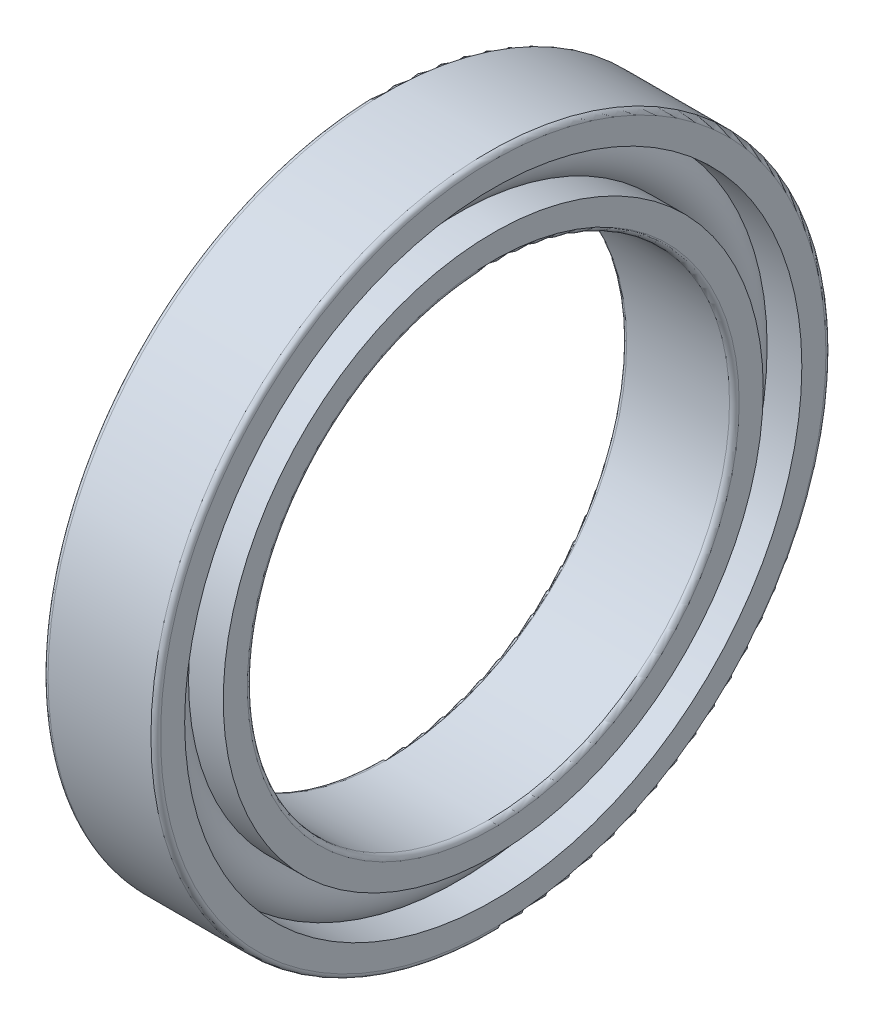
ISO-10303-21;
HEADER;
FILE_DESCRIPTION(('STEP AP214'),'2;1');
FILE_NAME('part.step','',(''),(''),'','','');
FILE_SCHEMA(('AUTOMOTIVE_DESIGN { 1 0 10303 214 1 1 1 1 }'));
ENDSEC;
DATA;
#1=APPLICATION_CONTEXT('core data for automotive mechanical design processes');
#2=APPLICATION_PROTOCOL_DEFINITION('international standard','automotive_design',2000,#1);
#3=PRODUCT_CONTEXT('',#1,'mechanical');
#4=PRODUCT('Part','Part','',(#3));
#5=PRODUCT_RELATED_PRODUCT_CATEGORY('part','',(#4));
#6=PRODUCT_DEFINITION_FORMATION('','',#4);
#7=PRODUCT_DEFINITION_CONTEXT('part definition',#1,'design');
#8=PRODUCT_DEFINITION('design','',#6,#7);
#9=PRODUCT_DEFINITION_SHAPE('','',#8);
#10=(LENGTH_UNIT() NAMED_UNIT(*) SI_UNIT(.MILLI.,.METRE.));
#11=(NAMED_UNIT(*) PLANE_ANGLE_UNIT() SI_UNIT($,.RADIAN.));
#12=(NAMED_UNIT(*) SI_UNIT($,.STERADIAN.) SOLID_ANGLE_UNIT());
#13=UNCERTAINTY_MEASURE_WITH_UNIT(LENGTH_MEASURE(1.E-05),#10,'distance_accuracy_value','');
#14=(GEOMETRIC_REPRESENTATION_CONTEXT(3) GLOBAL_UNCERTAINTY_ASSIGNED_CONTEXT((#13)) GLOBAL_UNIT_ASSIGNED_CONTEXT((#10,
#11,#12)) REPRESENTATION_CONTEXT('',''));
#15=CARTESIAN_POINT('',(0.,0.,0.));
#16=DIRECTION('',(0.,0.,1.));
#17=DIRECTION('',(1.,0.,0.));
#18=AXIS2_PLACEMENT_3D('',#15,#16,#17);
#19=CARTESIAN_POINT('',(0.,0.,0.));
#20=DIRECTION('',(-1.,0.,0.));
#21=DIRECTION('',(0.,0.,1.));
#22=AXIS2_PLACEMENT_3D('',#19,#20,#21);
#23=TOROIDAL_SURFACE('',#22,18.,1.8);
#24=CARTESIAN_POINT('',(1.34164078649987,0.,0.));
#25=DIRECTION('',(-1.,0.,0.));
#26=DIRECTION('',(0.,0.,1.));
#27=AXIS2_PLACEMENT_3D('',#24,#25,#26);
#28=CIRCLE('',#27,19.2);
#29=CARTESIAN_POINT('',(1.34164078649987,0.,19.2));
#30=VERTEX_POINT('',#29);
#31=EDGE_CURVE('E36',#30,#30,#28,.F.);
#32=ORIENTED_EDGE('',*,*,#31,.T.);
#33=EDGE_LOOP('',(#32));
#34=FACE_BOUND('',#33,.T.);
#35=CARTESIAN_POINT('',(1.34164078649988,0.,0.));
#36=DIRECTION('',(-1.,0.,0.));
#37=DIRECTION('',(0.,0.,1.));
#38=AXIS2_PLACEMENT_3D('',#35,#36,#37);
#39=CIRCLE('',#38,16.8);
#40=CARTESIAN_POINT('',(1.34164078649988,0.,16.8));
#41=VERTEX_POINT('',#40);
#42=EDGE_CURVE('E10',#41,#41,#39,.T.);
#43=ORIENTED_EDGE('',*,*,#42,.T.);
#44=EDGE_LOOP('',(#43));
#45=FACE_BOUND('',#44,.T.);
#46=ADVANCED_FACE('F32',(#34,#45),#23,.T.);
#47=CARTESIAN_POINT('',(-20.6375,0.,0.));
#48=DIRECTION('',(1.,0.,0.));
#49=DIRECTION('',(0.,0.,-1.));
#50=AXIS2_PLACEMENT_3D('',#47,#48,#49);
#51=CYLINDRICAL_SURFACE('',#50,16.8);
#52=CARTESIAN_POINT('',(3.5,0.,0.));
#53=DIRECTION('',(1.,0.,0.));
#54=DIRECTION('',(0.,0.,-1.));
#55=AXIS2_PLACEMENT_3D('',#52,#53,#54);
#56=CIRCLE('',#55,16.8);
#57=CARTESIAN_POINT('',(3.5,0.,-16.8));
#58=VERTEX_POINT('',#57);
#59=EDGE_CURVE('E45',#58,#58,#56,.T.);
#60=ORIENTED_EDGE('',*,*,#59,.F.);
#61=EDGE_LOOP('',(#60));
#62=FACE_BOUND('',#61,.T.);
#63=ORIENTED_EDGE('',*,*,#42,.F.);
#64=EDGE_LOOP('',(#63));
#65=FACE_BOUND('',#64,.T.);
#66=ADVANCED_FACE('F84',(#62,#65),#51,.T.);
#67=CARTESIAN_POINT('',(-20.6375,0.,0.));
#68=DIRECTION('',(1.,0.,0.));
#69=DIRECTION('',(0.,0.,-1.));
#70=AXIS2_PLACEMENT_3D('',#67,#68,#69);
#71=CYLINDRICAL_SURFACE('',#70,16.8);
#72=CARTESIAN_POINT('',(-3.5,0.,0.));
#73=DIRECTION('',(1.,0.,0.));
#74=DIRECTION('',(0.,0.,-1.));
#75=AXIS2_PLACEMENT_3D('',#72,#73,#74);
#76=CIRCLE('',#75,16.8);
#77=CARTESIAN_POINT('',(-3.5,0.,-16.8));
#78=VERTEX_POINT('',#77);
#79=EDGE_CURVE('E54',#78,#78,#76,.T.);
#80=ORIENTED_EDGE('',*,*,#79,.T.);
#81=EDGE_LOOP('',(#80));
#82=FACE_BOUND('',#81,.T.);
#83=CARTESIAN_POINT('',(-1.34164078649988,0.,0.));
#84=DIRECTION('',(1.,0.,0.));
#85=DIRECTION('',(0.,0.,-1.));
#86=AXIS2_PLACEMENT_3D('',#83,#84,#85);
#87=CIRCLE('',#86,16.8);
#88=CARTESIAN_POINT('',(-1.34164078649988,0.,-16.8));
#89=VERTEX_POINT('',#88);
#90=EDGE_CURVE('E40',#89,#89,#87,.T.);
#91=ORIENTED_EDGE('',*,*,#90,.F.);
#92=EDGE_LOOP('',(#91));
#93=FACE_BOUND('',#92,.T.);
#94=ADVANCED_FACE('F87',(#82,#93),#71,.T.);
#95=CARTESIAN_POINT('',(3.5,15.3,0.));
#96=DIRECTION('',(1.,0.,0.));
#97=DIRECTION('',(0.,0.,-1.));
#98=AXIS2_PLACEMENT_3D('',#95,#96,#97);
#99=PLANE('',#98);
#100=ORIENTED_EDGE('',*,*,#59,.T.);
#101=EDGE_LOOP('',(#100));
#102=FACE_BOUND('',#101,.T.);
#103=CARTESIAN_POINT('',(3.5,0.,0.));
#104=DIRECTION('',(1.,0.,0.));
#105=DIRECTION('',(0.,0.,-1.));
#106=AXIS2_PLACEMENT_3D('',#103,#104,#105);
#107=CIRCLE('',#106,15.3);
#108=CARTESIAN_POINT('',(3.5,0.,-15.3));
#109=VERTEX_POINT('',#108);
#110=EDGE_CURVE('E76',#109,#109,#107,.T.);
#111=ORIENTED_EDGE('',*,*,#110,.F.);
#112=EDGE_LOOP('',(#111));
#113=FACE_BOUND('',#112,.T.);
#114=ADVANCED_FACE('F81',(#102,#113),#99,.T.);
#115=CARTESIAN_POINT('',(3.2,0.,0.));
#116=DIRECTION('',(1.,0.,0.));
#117=DIRECTION('',(0.,0.,-1.));
#118=AXIS2_PLACEMENT_3D('',#115,#116,#117);
#119=TOROIDAL_SURFACE('',#118,15.3,0.3);
#120=ORIENTED_EDGE('',*,*,#110,.T.);
#121=EDGE_LOOP('',(#120));
#122=FACE_BOUND('',#121,.T.);
#123=CARTESIAN_POINT('',(3.2,0.,0.));
#124=DIRECTION('',(1.,0.,0.));
#125=DIRECTION('',(0.,0.,-1.));
#126=AXIS2_PLACEMENT_3D('',#123,#124,#125);
#127=CIRCLE('',#126,15.);
#128=CARTESIAN_POINT('',(3.2,0.,-15.));
#129=VERTEX_POINT('',#128);
#130=EDGE_CURVE('E73',#129,#129,#127,.T.);
#131=ORIENTED_EDGE('',*,*,#130,.F.);
#132=EDGE_LOOP('',(#131));
#133=FACE_BOUND('',#132,.T.);
#134=ADVANCED_FACE('F98',(#122,#133),#119,.T.);
#135=CARTESIAN_POINT('',(-20.6375,0.,0.));
#136=DIRECTION('',(1.,0.,0.));
#137=DIRECTION('',(0.,0.,-1.));
#138=AXIS2_PLACEMENT_3D('',#135,#136,#137);
#139=CYLINDRICAL_SURFACE('',#138,15.);
#140=ORIENTED_EDGE('',*,*,#130,.T.);
#141=EDGE_LOOP('',(#140));
#142=FACE_BOUND('',#141,.T.);
#143=CARTESIAN_POINT('',(-3.2,0.,0.));
#144=DIRECTION('',(1.,0.,0.));
#145=DIRECTION('',(0.,0.,-1.));
#146=AXIS2_PLACEMENT_3D('',#143,#144,#145);
#147=CIRCLE('',#146,15.);
#148=CARTESIAN_POINT('',(-3.2,0.,-15.));
#149=VERTEX_POINT('',#148);
#150=EDGE_CURVE('E70',#149,#149,#147,.T.);
#151=ORIENTED_EDGE('',*,*,#150,.F.);
#152=EDGE_LOOP('',(#151));
#153=FACE_BOUND('',#152,.T.);
#154=ADVANCED_FACE('F101',(#142,#153),#139,.F.);
#155=CARTESIAN_POINT('',(-3.2,0.,0.));
#156=DIRECTION('',(1.,0.,0.));
#157=DIRECTION('',(0.,0.,-1.));
#158=AXIS2_PLACEMENT_3D('',#155,#156,#157);
#159=TOROIDAL_SURFACE('',#158,15.3,0.3);
#160=ORIENTED_EDGE('',*,*,#150,.T.);
#161=EDGE_LOOP('',(#160));
#162=FACE_BOUND('',#161,.T.);
#163=CARTESIAN_POINT('',(-3.5,0.,0.));
#164=DIRECTION('',(1.,0.,0.));
#165=DIRECTION('',(0.,0.,-1.));
#166=AXIS2_PLACEMENT_3D('',#163,#164,#165);
#167=CIRCLE('',#166,15.3);
#168=CARTESIAN_POINT('',(-3.5,0.,-15.3));
#169=VERTEX_POINT('',#168);
#170=EDGE_CURVE('E67',#169,#169,#167,.T.);
#171=ORIENTED_EDGE('',*,*,#170,.F.);
#172=EDGE_LOOP('',(#171));
#173=FACE_BOUND('',#172,.T.);
#174=ADVANCED_FACE('F105',(#162,#173),#159,.T.);
#175=CARTESIAN_POINT('',(-3.5,16.8,0.));
#176=DIRECTION('',(-1.,0.,0.));
#177=DIRECTION('',(0.,0.,1.));
#178=AXIS2_PLACEMENT_3D('',#175,#176,#177);
#179=PLANE('',#178);
#180=ORIENTED_EDGE('',*,*,#170,.T.);
#181=EDGE_LOOP('',(#180));
#182=FACE_BOUND('',#181,.T.);
#183=ORIENTED_EDGE('',*,*,#79,.F.);
#184=EDGE_LOOP('',(#183));
#185=FACE_BOUND('',#184,.T.);
#186=ADVANCED_FACE('F109',(#182,#185),#179,.T.);
#187=CARTESIAN_POINT('',(-1.34164078649987,0.,0.));
#188=DIRECTION('',(1.,0.,0.));
#189=DIRECTION('',(0.,0.,-1.));
#190=AXIS2_PLACEMENT_3D('',#187,#188,#189);
#191=CIRCLE('',#190,19.2);
#192=CARTESIAN_POINT('',(-1.34164078649987,0.,-19.2));
#193=VERTEX_POINT('',#192);
#194=EDGE_CURVE('E48',#193,#193,#191,.F.);
#195=ORIENTED_EDGE('',*,*,#194,.T.);
#196=EDGE_LOOP('',(#195));
#197=FACE_BOUND('',#196,.T.);
#198=ORIENTED_EDGE('',*,*,#90,.T.);
#199=EDGE_LOOP('',(#198));
#200=FACE_BOUND('',#199,.T.);
#201=ADVANCED_FACE('F34',(#197,#200),#23,.T.);
#202=CARTESIAN_POINT('',(-20.6375,0.,0.));
#203=DIRECTION('',(1.,0.,0.));
#204=DIRECTION('',(0.,0.,-1.));
#205=AXIS2_PLACEMENT_3D('',#202,#203,#204);
#206=CYLINDRICAL_SURFACE('',#205,19.2);
#207=CARTESIAN_POINT('',(3.5,0.,0.));
#208=DIRECTION('',(1.,0.,0.));
#209=DIRECTION('',(0.,0.,-1.));
#210=AXIS2_PLACEMENT_3D('',#207,#208,#209);
#211=CIRCLE('',#210,19.2);
#212=CARTESIAN_POINT('',(3.5,0.,-19.2));
#213=VERTEX_POINT('',#212);
#214=EDGE_CURVE('E50',#213,#213,#211,.T.);
#215=ORIENTED_EDGE('',*,*,#214,.T.);
#216=EDGE_LOOP('',(#215));
#217=FACE_BOUND('',#216,.T.);
#218=ORIENTED_EDGE('',*,*,#31,.F.);
#219=EDGE_LOOP('',(#218));
#220=FACE_BOUND('',#219,.T.);
#221=ADVANCED_FACE('F114',(#217,#220),#206,.F.);
#222=CARTESIAN_POINT('',(-20.6375,0.,0.));
#223=DIRECTION('',(1.,0.,0.));
#224=DIRECTION('',(0.,0.,-1.));
#225=AXIS2_PLACEMENT_3D('',#222,#223,#224);
#226=CYLINDRICAL_SURFACE('',#225,19.2);
#227=CARTESIAN_POINT('',(-3.5,0.,0.));
#228=DIRECTION('',(1.,0.,0.));
#229=DIRECTION('',(0.,0.,-1.));
#230=AXIS2_PLACEMENT_3D('',#227,#228,#229);
#231=CIRCLE('',#230,19.2);
#232=CARTESIAN_POINT('',(-3.5,0.,-19.2));
#233=VERTEX_POINT('',#232);
#234=EDGE_CURVE('E145',#233,#233,#231,.T.);
#235=ORIENTED_EDGE('',*,*,#234,.F.);
#236=EDGE_LOOP('',(#235));
#237=FACE_BOUND('',#236,.T.);
#238=ORIENTED_EDGE('',*,*,#194,.F.);
#239=EDGE_LOOP('',(#238));
#240=FACE_BOUND('',#239,.T.);
#241=ADVANCED_FACE('F117',(#237,#240),#226,.F.);
#242=CARTESIAN_POINT('',(3.5,20.7,0.));
#243=DIRECTION('',(1.,0.,0.));
#244=DIRECTION('',(0.,0.,-1.));
#245=AXIS2_PLACEMENT_3D('',#242,#243,#244);
#246=PLANE('',#245);
#247=CARTESIAN_POINT('',(3.5,0.,0.));
#248=DIRECTION('',(1.,0.,0.));
#249=DIRECTION('',(0.,0.,-1.));
#250=AXIS2_PLACEMENT_3D('',#247,#248,#249);
#251=CIRCLE('',#250,20.7);
#252=CARTESIAN_POINT('',(3.5,0.,-20.7));
#253=VERTEX_POINT('',#252);
#254=EDGE_CURVE('E56',#253,#253,#251,.T.);
#255=ORIENTED_EDGE('',*,*,#254,.T.);
#256=EDGE_LOOP('',(#255));
#257=FACE_BOUND('',#256,.T.);
#258=ORIENTED_EDGE('',*,*,#214,.F.);
#259=EDGE_LOOP('',(#258));
#260=FACE_BOUND('',#259,.T.);
#261=ADVANCED_FACE('F118',(#257,#260),#246,.T.);
#262=CARTESIAN_POINT('',(3.2,0.,0.));
#263=DIRECTION('',(1.,0.,0.));
#264=DIRECTION('',(0.,0.,-1.));
#265=AXIS2_PLACEMENT_3D('',#262,#263,#264);
#266=TOROIDAL_SURFACE('',#265,20.7,0.299999999999996);
#267=CARTESIAN_POINT('',(3.2,0.,0.));
#268=DIRECTION('',(1.,0.,0.));
#269=DIRECTION('',(0.,0.,-1.));
#270=AXIS2_PLACEMENT_3D('',#267,#268,#269);
#271=CIRCLE('',#270,21.);
#272=CARTESIAN_POINT('',(3.2,0.,-21.));
#273=VERTEX_POINT('',#272);
#274=EDGE_CURVE('E61',#273,#273,#271,.T.);
#275=ORIENTED_EDGE('',*,*,#274,.T.);
#276=EDGE_LOOP('',(#275));
#277=FACE_BOUND('',#276,.T.);
#278=ORIENTED_EDGE('',*,*,#254,.F.);
#279=EDGE_LOOP('',(#278));
#280=FACE_BOUND('',#279,.T.);
#281=ADVANCED_FACE('F121',(#277,#280),#266,.T.);
#282=CARTESIAN_POINT('',(-20.6375,0.,0.));
#283=DIRECTION('',(1.,0.,0.));
#284=DIRECTION('',(0.,0.,-1.));
#285=AXIS2_PLACEMENT_3D('',#282,#283,#284);
#286=CYLINDRICAL_SURFACE('',#285,21.);
#287=CARTESIAN_POINT('',(-3.2,0.,0.));
#288=DIRECTION('',(1.,0.,0.));
#289=DIRECTION('',(0.,0.,-1.));
#290=AXIS2_PLACEMENT_3D('',#287,#288,#289);
#291=CIRCLE('',#290,21.);
#292=CARTESIAN_POINT('',(-3.2,0.,-21.));
#293=VERTEX_POINT('',#292);
#294=EDGE_CURVE('E149',#293,#293,#291,.T.);
#295=ORIENTED_EDGE('',*,*,#294,.T.);
#296=EDGE_LOOP('',(#295));
#297=FACE_BOUND('',#296,.T.);
#298=ORIENTED_EDGE('',*,*,#274,.F.);
#299=EDGE_LOOP('',(#298));
#300=FACE_BOUND('',#299,.T.);
#301=ADVANCED_FACE('F125',(#297,#300),#286,.T.);
#302=CARTESIAN_POINT('',(-3.2,0.,0.));
#303=DIRECTION('',(1.,0.,0.));
#304=DIRECTION('',(0.,0.,-1.));
#305=AXIS2_PLACEMENT_3D('',#302,#303,#304);
#306=TOROIDAL_SURFACE('',#305,20.7,0.299999999999996);
#307=CARTESIAN_POINT('',(-3.5,0.,0.));
#308=DIRECTION('',(1.,0.,0.));
#309=DIRECTION('',(0.,0.,-1.));
#310=AXIS2_PLACEMENT_3D('',#307,#308,#309);
#311=CIRCLE('',#310,20.7);
#312=CARTESIAN_POINT('',(-3.5,0.,-20.7));
#313=VERTEX_POINT('',#312);
#314=EDGE_CURVE('E146',#313,#313,#311,.T.);
#315=ORIENTED_EDGE('',*,*,#314,.T.);
#316=EDGE_LOOP('',(#315));
#317=FACE_BOUND('',#316,.T.);
#318=ORIENTED_EDGE('',*,*,#294,.F.);
#319=EDGE_LOOP('',(#318));
#320=FACE_BOUND('',#319,.T.);
#321=ADVANCED_FACE('F129',(#317,#320),#306,.T.);
#322=CARTESIAN_POINT('',(-3.5,19.2,0.));
#323=DIRECTION('',(-1.,0.,0.));
#324=DIRECTION('',(0.,0.,1.));
#325=AXIS2_PLACEMENT_3D('',#322,#323,#324);
#326=PLANE('',#325);
#327=ORIENTED_EDGE('',*,*,#234,.T.);
#328=EDGE_LOOP('',(#327));
#329=FACE_BOUND('',#328,.T.);
#330=ORIENTED_EDGE('',*,*,#314,.F.);
#331=EDGE_LOOP('',(#330));
#332=FACE_BOUND('',#331,.T.);
#333=ADVANCED_FACE('F133',(#329,#332),#326,.T.);
#334=CLOSED_SHELL('',(#46,#66,#94,#114,#134,#154,#174,#186,#201,#221,#241,#261,#281,#301,#321,#333));
#335=MANIFOLD_SOLID_BREP('B2',#334);
#336=ADVANCED_BREP_SHAPE_REPRESENTATION('',(#18,#335),#14);
#337=SHAPE_DEFINITION_REPRESENTATION(#9,#336);
ENDSEC;
END-ISO-10303-21;
